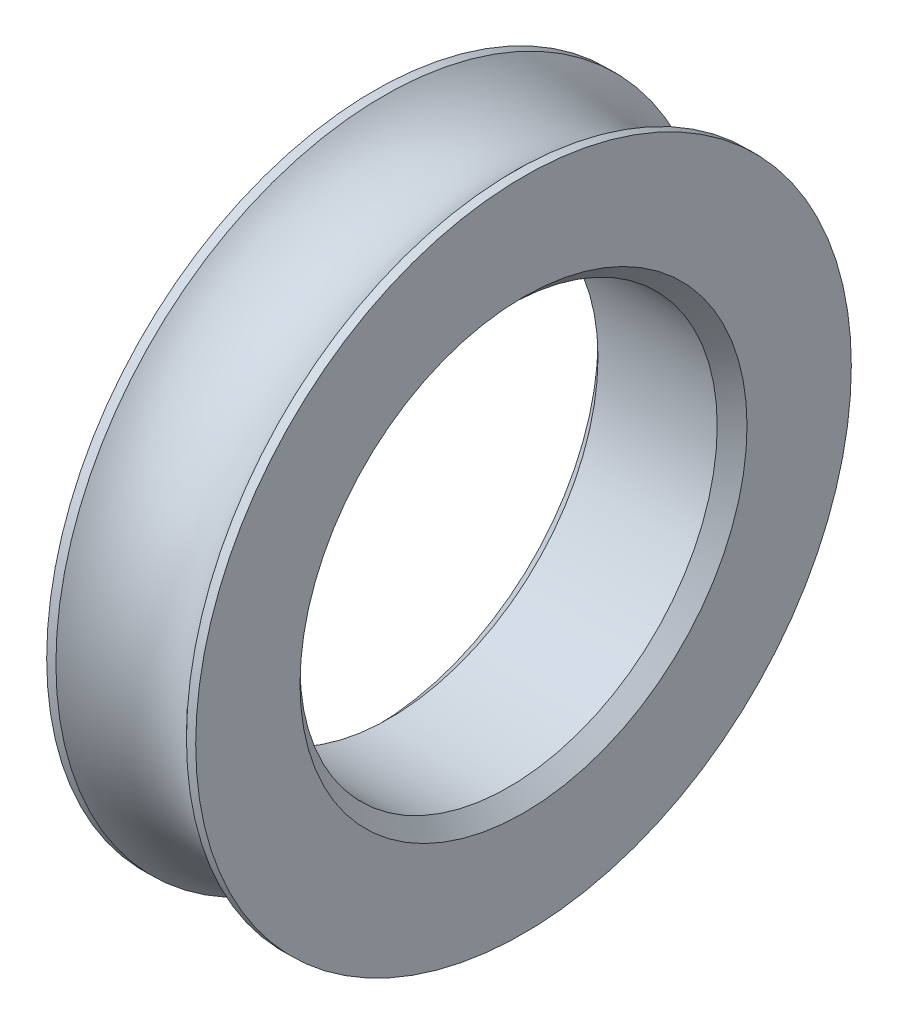
ISO-10303-21;
HEADER;
FILE_DESCRIPTION(('STEP AP214'),'2;1');
FILE_NAME('part.step','',(''),(''),'','','');
FILE_SCHEMA(('AUTOMOTIVE_DESIGN { 1 0 10303 214 1 1 1 1 }'));
ENDSEC;
DATA;
#1=APPLICATION_CONTEXT('core data for automotive mechanical design processes');
#2=APPLICATION_PROTOCOL_DEFINITION('international standard','automotive_design',2000,#1);
#3=PRODUCT_CONTEXT('',#1,'mechanical');
#4=PRODUCT('Part','Part','',(#3));
#5=PRODUCT_RELATED_PRODUCT_CATEGORY('part','',(#4));
#6=PRODUCT_DEFINITION_FORMATION('','',#4);
#7=PRODUCT_DEFINITION_CONTEXT('part definition',#1,'design');
#8=PRODUCT_DEFINITION('design','',#6,#7);
#9=PRODUCT_DEFINITION_SHAPE('','',#8);
#10=(LENGTH_UNIT() NAMED_UNIT(*) SI_UNIT(.MILLI.,.METRE.));
#11=(NAMED_UNIT(*) PLANE_ANGLE_UNIT() SI_UNIT($,.RADIAN.));
#12=(NAMED_UNIT(*) SI_UNIT($,.STERADIAN.) SOLID_ANGLE_UNIT());
#13=UNCERTAINTY_MEASURE_WITH_UNIT(LENGTH_MEASURE(1.E-05),#10,'distance_accuracy_value','');
#14=(GEOMETRIC_REPRESENTATION_CONTEXT(3) GLOBAL_UNCERTAINTY_ASSIGNED_CONTEXT((#13)) GLOBAL_UNIT_ASSIGNED_CONTEXT((#10,
#11,#12)) REPRESENTATION_CONTEXT('',''));
#15=CARTESIAN_POINT('',(0.,0.,0.));
#16=DIRECTION('',(0.,0.,1.));
#17=DIRECTION('',(1.,0.,0.));
#18=AXIS2_PLACEMENT_3D('',#15,#16,#17);
#19=CARTESIAN_POINT('',(2.5,7.,0.));
#20=DIRECTION('',(-1.,0.,0.));
#21=DIRECTION('',(0.,0.,1.));
#22=AXIS2_PLACEMENT_3D('',#19,#20,#21);
#23=PLANE('',#22);
#24=CARTESIAN_POINT('',(2.5,0.,0.));
#25=DIRECTION('',(-1.,0.,0.));
#26=DIRECTION('',(0.,0.,1.));
#27=AXIS2_PLACEMENT_3D('',#24,#25,#26);
#28=CIRCLE('',#27,7.5);
#29=CARTESIAN_POINT('',(2.5,0.,7.5));
#30=VERTEX_POINT('',#29);
#31=EDGE_CURVE('E10',#30,#30,#28,.T.);
#32=ORIENTED_EDGE('',*,*,#31,.T.);
#33=EDGE_LOOP('',(#32));
#34=FACE_BOUND('',#33,.T.);
#35=CARTESIAN_POINT('',(2.5,0.,0.));
#36=DIRECTION('',(-1.,0.,0.));
#37=DIRECTION('',(0.,0.,1.));
#38=AXIS2_PLACEMENT_3D('',#35,#36,#37);
#39=CIRCLE('',#38,11.);
#40=CARTESIAN_POINT('',(2.5,0.,11.));
#41=VERTEX_POINT('',#40);
#42=EDGE_CURVE('E51',#41,#41,#39,.T.);
#43=ORIENTED_EDGE('',*,*,#42,.F.);
#44=EDGE_LOOP('',(#43));
#45=FACE_BOUND('',#44,.T.);
#46=ADVANCED_FACE('F31',(#34,#45),#23,.F.);
#47=CARTESIAN_POINT('',(-15.9374999999998,0.,0.));
#48=DIRECTION('',(-1.,0.,0.));
#49=DIRECTION('',(0.,0.,1.));
#50=AXIS2_PLACEMENT_3D('',#47,#48,#49);
#51=CYLINDRICAL_SURFACE('',#50,11.);
#52=CARTESIAN_POINT('',(2.19031961138091,0.,0.));
#53=DIRECTION('',(-1.,0.,0.));
#54=DIRECTION('',(0.,0.,1.));
#55=AXIS2_PLACEMENT_3D('',#52,#53,#54);
#56=CIRCLE('',#55,11.);
#57=CARTESIAN_POINT('',(2.19031961138091,0.,11.));
#58=VERTEX_POINT('',#57);
#59=EDGE_CURVE('E54',#58,#58,#56,.T.);
#60=ORIENTED_EDGE('',*,*,#59,.F.);
#61=EDGE_LOOP('',(#60));
#62=FACE_BOUND('',#61,.T.);
#63=ORIENTED_EDGE('',*,*,#42,.T.);
#64=EDGE_LOOP('',(#63));
#65=FACE_BOUND('',#64,.T.);
#66=ADVANCED_FACE('F75',(#62,#65),#51,.T.);
#67=CARTESIAN_POINT('',(0.,0.,0.));
#68=DIRECTION('',(-1.,0.,0.));
#69=DIRECTION('',(0.,0.,1.));
#70=AXIS2_PLACEMENT_3D('',#67,#68,#69);
#71=TOROIDAL_SURFACE('',#70,13.05,3.);
#72=CARTESIAN_POINT('',(-2.190319611381,0.,0.));
#73=DIRECTION('',(-1.,0.,0.));
#74=DIRECTION('',(0.,0.,1.));
#75=AXIS2_PLACEMENT_3D('',#72,#73,#74);
#76=CIRCLE('',#75,11.);
#77=CARTESIAN_POINT('',(-2.190319611381,0.,11.));
#78=VERTEX_POINT('',#77);
#79=EDGE_CURVE('E57',#78,#78,#76,.T.);
#80=ORIENTED_EDGE('',*,*,#79,.F.);
#81=EDGE_LOOP('',(#80));
#82=FACE_BOUND('',#81,.T.);
#83=ORIENTED_EDGE('',*,*,#59,.T.);
#84=EDGE_LOOP('',(#83));
#85=FACE_BOUND('',#84,.T.);
#86=ADVANCED_FACE('F69',(#82,#85),#71,.F.);
#87=CARTESIAN_POINT('',(-15.9374999999998,0.,0.));
#88=DIRECTION('',(-1.,0.,0.));
#89=DIRECTION('',(0.,0.,1.));
#90=AXIS2_PLACEMENT_3D('',#87,#88,#89);
#91=CYLINDRICAL_SURFACE('',#90,11.);
#92=CARTESIAN_POINT('',(-2.5,0.,0.));
#93=DIRECTION('',(-1.,0.,0.));
#94=DIRECTION('',(0.,0.,1.));
#95=AXIS2_PLACEMENT_3D('',#92,#93,#94);
#96=CIRCLE('',#95,11.);
#97=CARTESIAN_POINT('',(-2.5,0.,11.));
#98=VERTEX_POINT('',#97);
#99=EDGE_CURVE('E60',#98,#98,#96,.T.);
#100=ORIENTED_EDGE('',*,*,#99,.F.);
#101=EDGE_LOOP('',(#100));
#102=FACE_BOUND('',#101,.T.);
#103=ORIENTED_EDGE('',*,*,#79,.T.);
#104=EDGE_LOOP('',(#103));
#105=FACE_BOUND('',#104,.T.);
#106=ADVANCED_FACE('F66',(#102,#105),#91,.T.);
#107=CARTESIAN_POINT('',(-2.5,7.,0.));
#108=DIRECTION('',(1.,0.,0.));
#109=DIRECTION('',(0.,0.,-1.));
#110=AXIS2_PLACEMENT_3D('',#107,#108,#109);
#111=PLANE('',#110);
#112=CARTESIAN_POINT('',(-2.5,0.,0.));
#113=DIRECTION('',(1.,0.,0.));
#114=DIRECTION('',(0.,0.,-1.));
#115=AXIS2_PLACEMENT_3D('',#112,#113,#114);
#116=CIRCLE('',#115,7.5);
#117=CARTESIAN_POINT('',(-2.5,0.,-7.5));
#118=VERTEX_POINT('',#117);
#119=EDGE_CURVE('E38',#118,#118,#116,.T.);
#120=ORIENTED_EDGE('',*,*,#119,.T.);
#121=EDGE_LOOP('',(#120));
#122=FACE_BOUND('',#121,.T.);
#123=ORIENTED_EDGE('',*,*,#99,.T.);
#124=EDGE_LOOP('',(#123));
#125=FACE_BOUND('',#124,.T.);
#126=ADVANCED_FACE('F64',(#122,#125),#111,.F.);
#127=CARTESIAN_POINT('',(-15.9374999999998,0.,0.));
#128=DIRECTION('',(-1.,0.,0.));
#129=DIRECTION('',(0.,0.,1.));
#130=AXIS2_PLACEMENT_3D('',#127,#128,#129);
#131=CYLINDRICAL_SURFACE('',#130,7.);
#132=CARTESIAN_POINT('',(-2.,0.,0.));
#133=DIRECTION('',(1.,0.,0.));
#134=DIRECTION('',(0.,0.,-1.));
#135=AXIS2_PLACEMENT_3D('',#132,#133,#134);
#136=CIRCLE('',#135,7.);
#137=CARTESIAN_POINT('',(-2.,0.,-7.));
#138=VERTEX_POINT('',#137);
#139=EDGE_CURVE('E42',#138,#138,#136,.F.);
#140=ORIENTED_EDGE('',*,*,#139,.T.);
#141=EDGE_LOOP('',(#140));
#142=FACE_BOUND('',#141,.T.);
#143=CARTESIAN_POINT('',(2.,0.,0.));
#144=DIRECTION('',(-1.,0.,0.));
#145=DIRECTION('',(0.,0.,1.));
#146=AXIS2_PLACEMENT_3D('',#143,#144,#145);
#147=CIRCLE('',#146,7.);
#148=CARTESIAN_POINT('',(2.,0.,7.));
#149=VERTEX_POINT('',#148);
#150=EDGE_CURVE('E46',#149,#149,#147,.F.);
#151=ORIENTED_EDGE('',*,*,#150,.T.);
#152=EDGE_LOOP('',(#151));
#153=FACE_BOUND('',#152,.T.);
#154=ADVANCED_FACE('F90',(#142,#153),#131,.F.);
#155=CARTESIAN_POINT('',(-2.,0.,0.));
#156=DIRECTION('',(-1.,0.,0.));
#157=DIRECTION('',(0.,0.,1.));
#158=AXIS2_PLACEMENT_3D('',#155,#156,#157);
#159=CONICAL_SURFACE('',#158,7.,0.785398163397451);
#160=ORIENTED_EDGE('',*,*,#119,.F.);
#161=EDGE_LOOP('',(#160));
#162=FACE_BOUND('',#161,.T.);
#163=ORIENTED_EDGE('',*,*,#139,.F.);
#164=EDGE_LOOP('',(#163));
#165=FACE_BOUND('',#164,.T.);
#166=ADVANCED_FACE('F88',(#162,#165),#159,.F.);
#167=CARTESIAN_POINT('',(2.5,0.,0.));
#168=DIRECTION('',(1.,0.,0.));
#169=DIRECTION('',(0.,0.,-1.));
#170=AXIS2_PLACEMENT_3D('',#167,#168,#169);
#171=CONICAL_SURFACE('',#170,7.5,0.785398163397443);
#172=ORIENTED_EDGE('',*,*,#150,.F.);
#173=EDGE_LOOP('',(#172));
#174=FACE_BOUND('',#173,.T.);
#175=ORIENTED_EDGE('',*,*,#31,.F.);
#176=EDGE_LOOP('',(#175));
#177=FACE_BOUND('',#176,.T.);
#178=ADVANCED_FACE('F33',(#174,#177),#171,.F.);
#179=CLOSED_SHELL('',(#46,#66,#86,#106,#126,#154,#166,#178));
#180=MANIFOLD_SOLID_BREP('B2',#179);
#181=ADVANCED_BREP_SHAPE_REPRESENTATION('',(#18,#180),#14);
#182=SHAPE_DEFINITION_REPRESENTATION(#9,#181);
ENDSEC;
END-ISO-10303-21;
